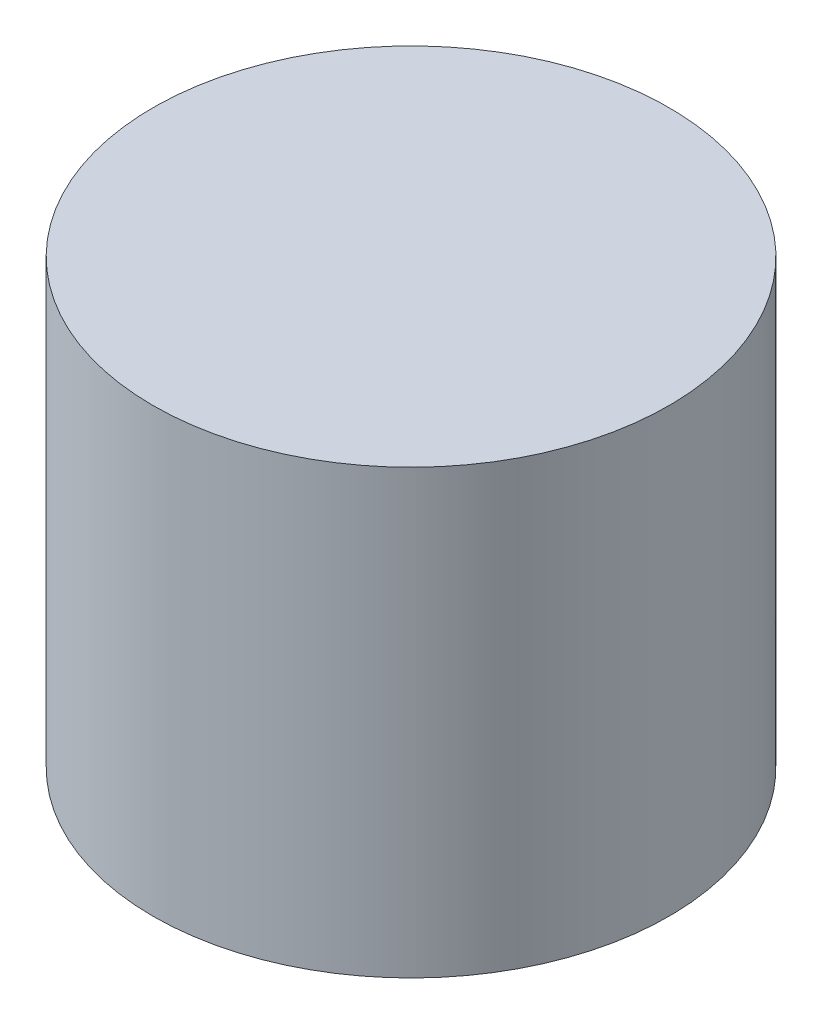
ISO-10303-21;
HEADER;
FILE_DESCRIPTION(('STEP AP214'),'2;1');
FILE_NAME('part.step','',(''),(''),'','','');
FILE_SCHEMA(('AUTOMOTIVE_DESIGN { 1 0 10303 214 1 1 1 1 }'));
ENDSEC;
DATA;
#1=APPLICATION_CONTEXT('core data for automotive mechanical design processes');
#2=APPLICATION_PROTOCOL_DEFINITION('international standard','automotive_design',2000,#1);
#3=PRODUCT_CONTEXT('',#1,'mechanical');
#4=PRODUCT('Part','Part','',(#3));
#5=PRODUCT_RELATED_PRODUCT_CATEGORY('part','',(#4));
#6=PRODUCT_DEFINITION_FORMATION('','',#4);
#7=PRODUCT_DEFINITION_CONTEXT('part definition',#1,'design');
#8=PRODUCT_DEFINITION('design','',#6,#7);
#9=PRODUCT_DEFINITION_SHAPE('','',#8);
#10=(LENGTH_UNIT() NAMED_UNIT(*) SI_UNIT(.MILLI.,.METRE.));
#11=(NAMED_UNIT(*) PLANE_ANGLE_UNIT() SI_UNIT($,.RADIAN.));
#12=(NAMED_UNIT(*) SI_UNIT($,.STERADIAN.) SOLID_ANGLE_UNIT());
#13=UNCERTAINTY_MEASURE_WITH_UNIT(LENGTH_MEASURE(1.E-05),#10,'distance_accuracy_value','');
#14=(GEOMETRIC_REPRESENTATION_CONTEXT(3) GLOBAL_UNCERTAINTY_ASSIGNED_CONTEXT((#13)) GLOBAL_UNIT_ASSIGNED_CONTEXT((#10,
#11,#12)) REPRESENTATION_CONTEXT('',''));
#15=CARTESIAN_POINT('',(0.,0.,0.));
#16=DIRECTION('',(0.,0.,1.));
#17=DIRECTION('',(1.,0.,0.));
#18=AXIS2_PLACEMENT_3D('',#15,#16,#17);
#19=CARTESIAN_POINT('',(0.,5.4,3.00909938374616));
#20=DIRECTION('',(0.,-1.,0.));
#21=DIRECTION('',(0.,0.,-1.));
#22=AXIS2_PLACEMENT_3D('',#19,#20,#21);
#23=CYLINDRICAL_SURFACE('',#22,3.15);
#24=CARTESIAN_POINT('',(0.,5.4,3.00909938374616));
#25=DIRECTION('',(0.,1.,0.));
#26=DIRECTION('',(0.,0.,1.));
#27=AXIS2_PLACEMENT_3D('',#24,#25,#26);
#28=CIRCLE('',#27,3.15);
#29=CARTESIAN_POINT('',(0.,5.4,6.15909938374616));
#30=VERTEX_POINT('',#29);
#31=EDGE_CURVE('E10',#30,#30,#28,.T.);
#32=ORIENTED_EDGE('',*,*,#31,.F.);
#33=EDGE_LOOP('',(#32));
#34=FACE_BOUND('',#33,.T.);
#35=CARTESIAN_POINT('',(0.,0.,3.00909938374616));
#36=DIRECTION('',(0.,1.,0.));
#37=DIRECTION('',(0.,0.,1.));
#38=AXIS2_PLACEMENT_3D('',#35,#36,#37);
#39=CIRCLE('',#38,3.15);
#40=CARTESIAN_POINT('',(0.,0.,6.15909938374616));
#41=VERTEX_POINT('',#40);
#42=EDGE_CURVE('E34',#41,#41,#39,.T.);
#43=ORIENTED_EDGE('',*,*,#42,.T.);
#44=EDGE_LOOP('',(#43));
#45=FACE_BOUND('',#44,.T.);
#46=ADVANCED_FACE('F31',(#34,#45),#23,.T.);
#47=CARTESIAN_POINT('',(0.,5.4,3.00909938374616));
#48=DIRECTION('',(0.,1.,0.));
#49=DIRECTION('',(0.,0.,1.));
#50=AXIS2_PLACEMENT_3D('',#47,#48,#49);
#51=PLANE('',#50);
#52=ORIENTED_EDGE('',*,*,#31,.T.);
#53=EDGE_LOOP('',(#52));
#54=FACE_BOUND('',#53,.T.);
#55=ADVANCED_FACE('F46',(#54),#51,.T.);
#56=CARTESIAN_POINT('',(0.,0.,3.00909938374616));
#57=DIRECTION('',(0.,1.,0.));
#58=DIRECTION('',(0.,0.,1.));
#59=AXIS2_PLACEMENT_3D('',#56,#57,#58);
#60=PLANE('',#59);
#61=ORIENTED_EDGE('',*,*,#42,.F.);
#62=EDGE_LOOP('',(#61));
#63=FACE_BOUND('',#62,.T.);
#64=ADVANCED_FACE('F44',(#63),#60,.F.);
#65=CLOSED_SHELL('',(#46,#55,#64));
#66=MANIFOLD_SOLID_BREP('B2',#65);
#67=ADVANCED_BREP_SHAPE_REPRESENTATION('',(#18,#66),#14);
#68=SHAPE_DEFINITION_REPRESENTATION(#9,#67);
ENDSEC;
END-ISO-10303-21;
